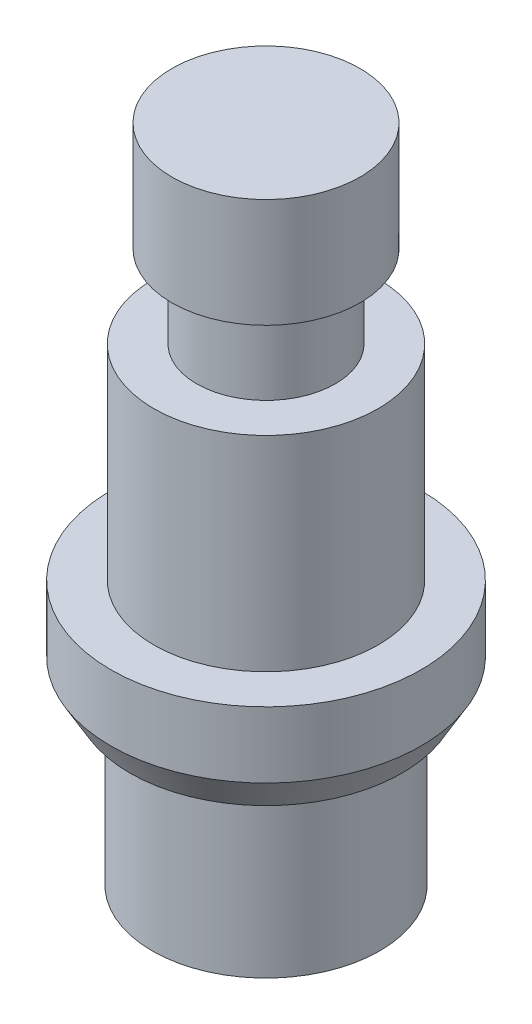
ISO-10303-21;
HEADER;
FILE_DESCRIPTION(('STEP AP214'),'2;1');
FILE_NAME('part.step','',(''),(''),'','','');
FILE_SCHEMA(('AUTOMOTIVE_DESIGN { 1 0 10303 214 1 1 1 1 }'));
ENDSEC;
DATA;
#1=APPLICATION_CONTEXT('core data for automotive mechanical design processes');
#2=APPLICATION_PROTOCOL_DEFINITION('international standard','automotive_design',2000,#1);
#3=PRODUCT_CONTEXT('',#1,'mechanical');
#4=PRODUCT('Part','Part','',(#3));
#5=PRODUCT_RELATED_PRODUCT_CATEGORY('part','',(#4));
#6=PRODUCT_DEFINITION_FORMATION('','',#4);
#7=PRODUCT_DEFINITION_CONTEXT('part definition',#1,'design');
#8=PRODUCT_DEFINITION('design','',#6,#7);
#9=PRODUCT_DEFINITION_SHAPE('','',#8);
#10=(LENGTH_UNIT() NAMED_UNIT(*) SI_UNIT(.MILLI.,.METRE.));
#11=(NAMED_UNIT(*) PLANE_ANGLE_UNIT() SI_UNIT($,.RADIAN.));
#12=(NAMED_UNIT(*) SI_UNIT($,.STERADIAN.) SOLID_ANGLE_UNIT());
#13=UNCERTAINTY_MEASURE_WITH_UNIT(LENGTH_MEASURE(1.E-05),#10,'distance_accuracy_value','');
#14=(GEOMETRIC_REPRESENTATION_CONTEXT(3) GLOBAL_UNCERTAINTY_ASSIGNED_CONTEXT((#13)) GLOBAL_UNIT_ASSIGNED_CONTEXT((#10,
#11,#12)) REPRESENTATION_CONTEXT('',''));
#15=CARTESIAN_POINT('',(0.,0.,0.));
#16=DIRECTION('',(0.,0.,1.));
#17=DIRECTION('',(1.,0.,0.));
#18=AXIS2_PLACEMENT_3D('',#15,#16,#17);
#19=CARTESIAN_POINT('',(0.,8.,0.));
#20=DIRECTION('',(0.,1.,0.));
#21=DIRECTION('',(0.,0.,1.));
#22=AXIS2_PLACEMENT_3D('',#19,#20,#21);
#23=CYLINDRICAL_SURFACE('',#22,3.4);
#24=CARTESIAN_POINT('',(0.,8.,0.));
#25=DIRECTION('',(0.,1.,0.));
#26=DIRECTION('',(0.,0.,1.));
#27=AXIS2_PLACEMENT_3D('',#24,#25,#26);
#28=CIRCLE('',#27,3.4);
#29=CARTESIAN_POINT('',(0.,8.,3.4));
#30=VERTEX_POINT('',#29);
#31=EDGE_CURVE('E62',#30,#30,#28,.T.);
#32=ORIENTED_EDGE('',*,*,#31,.T.);
#33=EDGE_LOOP('',(#32));
#34=FACE_BOUND('',#33,.T.);
#35=CARTESIAN_POINT('',(0.,14.2,0.));
#36=DIRECTION('',(0.,1.,0.));
#37=DIRECTION('',(0.,0.,1.));
#38=AXIS2_PLACEMENT_3D('',#35,#36,#37);
#39=CIRCLE('',#38,3.4);
#40=CARTESIAN_POINT('',(0.,14.2,3.4));
#41=VERTEX_POINT('',#40);
#42=EDGE_CURVE('E54',#41,#41,#39,.F.);
#43=ORIENTED_EDGE('',*,*,#42,.T.);
#44=EDGE_LOOP('',(#43));
#45=FACE_BOUND('',#44,.T.);
#46=ADVANCED_FACE('F36',(#34,#45),#23,.T.);
#47=CARTESIAN_POINT('',(0.,20.,0.));
#48=DIRECTION('',(0.,-1.,0.));
#49=DIRECTION('',(0.,0.,-1.));
#50=AXIS2_PLACEMENT_3D('',#47,#48,#49);
#51=CYLINDRICAL_SURFACE('',#50,4.7);
#52=CARTESIAN_POINT('',(0.,6.00000000000001,0.));
#53=DIRECTION('',(0.,-1.,0.));
#54=DIRECTION('',(0.,0.,-1.));
#55=AXIS2_PLACEMENT_3D('',#52,#53,#54);
#56=CIRCLE('',#55,4.7);
#57=CARTESIAN_POINT('',(0.,6.00000000000001,-4.7));
#58=VERTEX_POINT('',#57);
#59=EDGE_CURVE('E11',#58,#58,#56,.F.);
#60=ORIENTED_EDGE('',*,*,#59,.T.);
#61=EDGE_LOOP('',(#60));
#62=FACE_BOUND('',#61,.T.);
#63=CARTESIAN_POINT('',(0.,8.,0.));
#64=DIRECTION('',(0.,1.,0.));
#65=DIRECTION('',(0.,0.,1.));
#66=AXIS2_PLACEMENT_3D('',#63,#64,#65);
#67=CIRCLE('',#66,4.7);
#68=CARTESIAN_POINT('',(0.,8.,4.7));
#69=VERTEX_POINT('',#68);
#70=EDGE_CURVE('E59',#69,#69,#67,.T.);
#71=ORIENTED_EDGE('',*,*,#70,.F.);
#72=EDGE_LOOP('',(#71));
#73=FACE_BOUND('',#72,.T.);
#74=ADVANCED_FACE('F99',(#62,#73),#51,.T.);
#75=CARTESIAN_POINT('',(0.,5.,0.));
#76=DIRECTION('',(0.,-1.,0.));
#77=DIRECTION('',(0.,0.,-1.));
#78=AXIS2_PLACEMENT_3D('',#75,#76,#77);
#79=PLANE('',#78);
#80=CARTESIAN_POINT('',(0.,5.,0.));
#81=DIRECTION('',(0.,-1.,0.));
#82=DIRECTION('',(0.,0.,-1.));
#83=AXIS2_PLACEMENT_3D('',#80,#81,#82);
#84=CIRCLE('',#83,4.12264973081037);
#85=CARTESIAN_POINT('',(0.,5.,-4.12264973081037));
#86=VERTEX_POINT('',#85);
#87=EDGE_CURVE('E43',#86,#86,#84,.T.);
#88=ORIENTED_EDGE('',*,*,#87,.T.);
#89=EDGE_LOOP('',(#88));
#90=FACE_BOUND('',#89,.T.);
#91=CARTESIAN_POINT('',(0.,5.,0.));
#92=DIRECTION('',(0.,-1.,0.));
#93=DIRECTION('',(0.,0.,-1.));
#94=AXIS2_PLACEMENT_3D('',#91,#92,#93);
#95=CIRCLE('',#94,3.45);
#96=CARTESIAN_POINT('',(0.,5.,-3.45));
#97=VERTEX_POINT('',#96);
#98=EDGE_CURVE('E47',#97,#97,#95,.T.);
#99=ORIENTED_EDGE('',*,*,#98,.F.);
#100=EDGE_LOOP('',(#99));
#101=FACE_BOUND('',#100,.T.);
#102=ADVANCED_FACE('F105',(#90,#101),#79,.T.);
#103=CARTESIAN_POINT('',(0.,5.,0.));
#104=DIRECTION('',(0.,-1.,0.));
#105=DIRECTION('',(0.,0.,-1.));
#106=AXIS2_PLACEMENT_3D('',#103,#104,#105);
#107=CYLINDRICAL_SURFACE('',#106,3.45);
#108=ORIENTED_EDGE('',*,*,#98,.T.);
#109=EDGE_LOOP('',(#108));
#110=FACE_BOUND('',#109,.T.);
#111=CARTESIAN_POINT('',(0.,0.,0.));
#112=DIRECTION('',(0.,-1.,0.));
#113=DIRECTION('',(0.,0.,-1.));
#114=AXIS2_PLACEMENT_3D('',#111,#112,#113);
#115=CIRCLE('',#114,3.45);
#116=CARTESIAN_POINT('',(0.,0.,-3.45));
#117=VERTEX_POINT('',#116);
#118=EDGE_CURVE('E51',#117,#117,#115,.T.);
#119=ORIENTED_EDGE('',*,*,#118,.F.);
#120=EDGE_LOOP('',(#119));
#121=FACE_BOUND('',#120,.T.);
#122=ADVANCED_FACE('F110',(#110,#121),#107,.T.);
#123=CARTESIAN_POINT('',(0.,0.,0.));
#124=DIRECTION('',(0.,1.,0.));
#125=DIRECTION('',(0.,0.,1.));
#126=AXIS2_PLACEMENT_3D('',#123,#124,#125);
#127=PLANE('',#126);
#128=ORIENTED_EDGE('',*,*,#118,.T.);
#129=EDGE_LOOP('',(#128));
#130=FACE_BOUND('',#129,.T.);
#131=ADVANCED_FACE('F93',(#130),#127,.F.);
#132=CARTESIAN_POINT('',(0.,8.,0.));
#133=DIRECTION('',(0.,1.,0.));
#134=DIRECTION('',(0.,0.,1.));
#135=AXIS2_PLACEMENT_3D('',#132,#133,#134);
#136=PLANE('',#135);
#137=ORIENTED_EDGE('',*,*,#31,.F.);
#138=EDGE_LOOP('',(#137));
#139=FACE_BOUND('',#138,.T.);
#140=ORIENTED_EDGE('',*,*,#70,.T.);
#141=EDGE_LOOP('',(#140));
#142=FACE_BOUND('',#141,.T.);
#143=ADVANCED_FACE('F84',(#139,#142),#136,.T.);
#144=CARTESIAN_POINT('',(0.,14.2,0.));
#145=DIRECTION('',(0.,1.,0.));
#146=DIRECTION('',(0.,0.,1.));
#147=AXIS2_PLACEMENT_3D('',#144,#145,#146);
#148=PLANE('',#147);
#149=ORIENTED_EDGE('',*,*,#42,.F.);
#150=EDGE_LOOP('',(#149));
#151=FACE_BOUND('',#150,.T.);
#152=CARTESIAN_POINT('',(0.,14.2,0.));
#153=DIRECTION('',(0.,1.,0.));
#154=DIRECTION('',(0.,0.,1.));
#155=AXIS2_PLACEMENT_3D('',#152,#153,#154);
#156=CIRCLE('',#155,2.1);
#157=CARTESIAN_POINT('',(0.,14.2,2.1));
#158=VERTEX_POINT('',#157);
#159=EDGE_CURVE('E71',#158,#158,#156,.T.);
#160=ORIENTED_EDGE('',*,*,#159,.F.);
#161=EDGE_LOOP('',(#160));
#162=FACE_BOUND('',#161,.T.);
#163=ADVANCED_FACE('F81',(#151,#162),#148,.T.);
#164=CARTESIAN_POINT('',(0.,16.7,0.));
#165=DIRECTION('',(0.,1.,0.));
#166=DIRECTION('',(0.,0.,1.));
#167=AXIS2_PLACEMENT_3D('',#164,#165,#166);
#168=PLANE('',#167);
#169=CARTESIAN_POINT('',(0.,16.7,0.));
#170=DIRECTION('',(0.,1.,0.));
#171=DIRECTION('',(0.,0.,1.));
#172=AXIS2_PLACEMENT_3D('',#169,#170,#171);
#173=CIRCLE('',#172,2.85);
#174=CARTESIAN_POINT('',(0.,16.7,2.85));
#175=VERTEX_POINT('',#174);
#176=EDGE_CURVE('E58',#175,#175,#173,.F.);
#177=ORIENTED_EDGE('',*,*,#176,.T.);
#178=EDGE_LOOP('',(#177));
#179=FACE_BOUND('',#178,.T.);
#180=CARTESIAN_POINT('',(0.,16.7,0.));
#181=DIRECTION('',(0.,1.,0.));
#182=DIRECTION('',(0.,0.,1.));
#183=AXIS2_PLACEMENT_3D('',#180,#181,#182);
#184=CIRCLE('',#183,2.1);
#185=CARTESIAN_POINT('',(0.,16.7,2.1));
#186=VERTEX_POINT('',#185);
#187=EDGE_CURVE('E72',#186,#186,#184,.T.);
#188=ORIENTED_EDGE('',*,*,#187,.T.);
#189=EDGE_LOOP('',(#188));
#190=FACE_BOUND('',#189,.T.);
#191=ADVANCED_FACE('F83',(#179,#190),#168,.F.);
#192=CARTESIAN_POINT('',(0.,14.2,0.));
#193=DIRECTION('',(0.,1.,0.));
#194=DIRECTION('',(0.,0.,1.));
#195=AXIS2_PLACEMENT_3D('',#192,#193,#194);
#196=CYLINDRICAL_SURFACE('',#195,2.1);
#197=ORIENTED_EDGE('',*,*,#159,.T.);
#198=EDGE_LOOP('',(#197));
#199=FACE_BOUND('',#198,.T.);
#200=ORIENTED_EDGE('',*,*,#187,.F.);
#201=EDGE_LOOP('',(#200));
#202=FACE_BOUND('',#201,.T.);
#203=ADVANCED_FACE('F78',(#199,#202),#196,.T.);
#204=CARTESIAN_POINT('',(0.,20.,0.));
#205=DIRECTION('',(0.,1.,0.));
#206=DIRECTION('',(0.,0.,1.));
#207=AXIS2_PLACEMENT_3D('',#204,#205,#206);
#208=PLANE('',#207);
#209=CARTESIAN_POINT('',(0.,20.,0.));
#210=DIRECTION('',(0.,1.,0.));
#211=DIRECTION('',(0.,0.,1.));
#212=AXIS2_PLACEMENT_3D('',#209,#210,#211);
#213=CIRCLE('',#212,2.85);
#214=CARTESIAN_POINT('',(0.,20.,2.85));
#215=VERTEX_POINT('',#214);
#216=EDGE_CURVE('E57',#215,#215,#213,.T.);
#217=ORIENTED_EDGE('',*,*,#216,.T.);
#218=EDGE_LOOP('',(#217));
#219=FACE_BOUND('',#218,.T.);
#220=ADVANCED_FACE('F116',(#219),#208,.T.);
#221=CARTESIAN_POINT('',(0.,16.7,0.));
#222=DIRECTION('',(0.,1.,0.));
#223=DIRECTION('',(0.,0.,1.));
#224=AXIS2_PLACEMENT_3D('',#221,#222,#223);
#225=CYLINDRICAL_SURFACE('',#224,2.85);
#226=ORIENTED_EDGE('',*,*,#176,.F.);
#227=EDGE_LOOP('',(#226));
#228=FACE_BOUND('',#227,.T.);
#229=ORIENTED_EDGE('',*,*,#216,.F.);
#230=EDGE_LOOP('',(#229));
#231=FACE_BOUND('',#230,.T.);
#232=ADVANCED_FACE('F108',(#228,#231),#225,.T.);
#233=CARTESIAN_POINT('',(0.,5.,0.));
#234=DIRECTION('',(0.,1.,0.));
#235=DIRECTION('',(0.,0.,1.));
#236=AXIS2_PLACEMENT_3D('',#233,#234,#235);
#237=CONICAL_SURFACE('',#236,4.12264973081037,0.523598775598298);
#238=ORIENTED_EDGE('',*,*,#59,.F.);
#239=EDGE_LOOP('',(#238));
#240=FACE_BOUND('',#239,.T.);
#241=ORIENTED_EDGE('',*,*,#87,.F.);
#242=EDGE_LOOP('',(#241));
#243=FACE_BOUND('',#242,.T.);
#244=ADVANCED_FACE('F38',(#240,#243),#237,.T.);
#245=CLOSED_SHELL('',(#46,#74,#102,#122,#131,#143,#163,#191,#203,#220,#232,#244));
#246=MANIFOLD_SOLID_BREP('B2',#245);
#247=ADVANCED_BREP_SHAPE_REPRESENTATION('',(#18,#246),#14);
#248=SHAPE_DEFINITION_REPRESENTATION(#9,#247);
ENDSEC;
END-ISO-10303-21;
